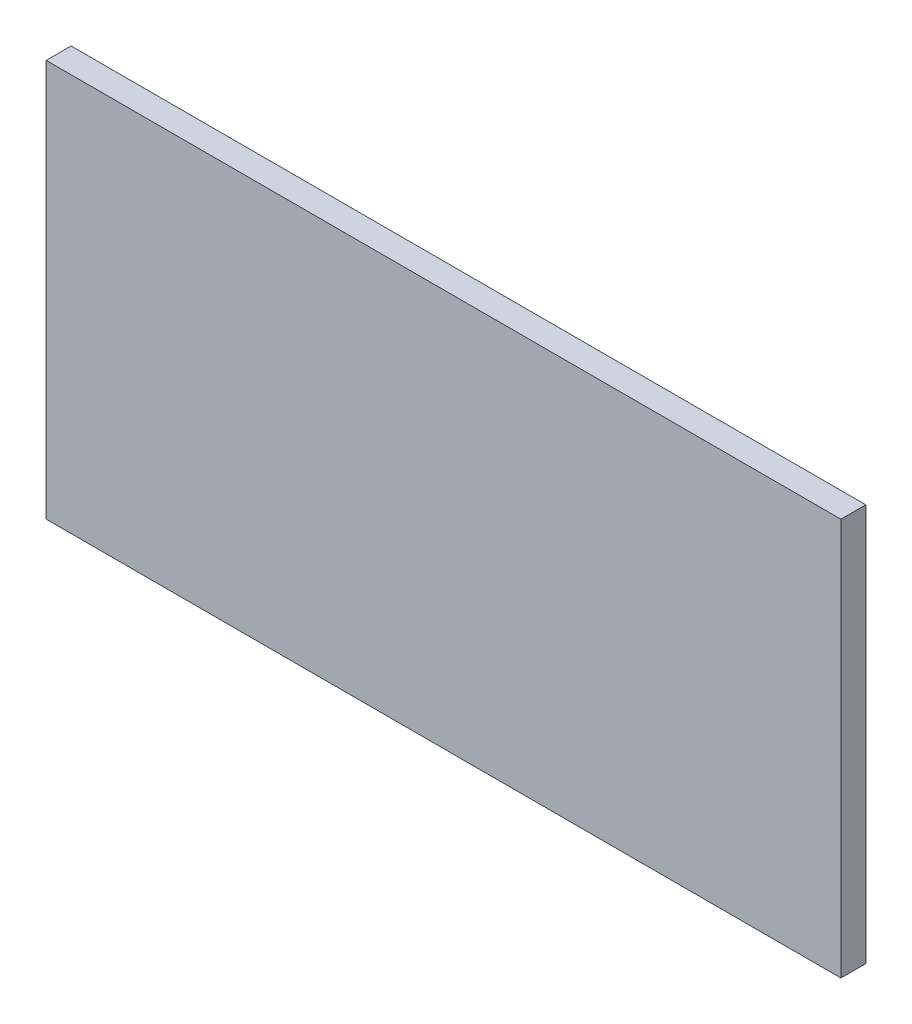
ISO-10303-21;
HEADER;
FILE_DESCRIPTION(('STEP AP214'),'2;1');
FILE_NAME('part.step','',(''),(''),'','','');
FILE_SCHEMA(('AUTOMOTIVE_DESIGN { 1 0 10303 214 1 1 1 1 }'));
ENDSEC;
DATA;
#1=APPLICATION_CONTEXT('core data for automotive mechanical design processes');
#2=APPLICATION_PROTOCOL_DEFINITION('international standard','automotive_design',2000,#1);
#3=PRODUCT_CONTEXT('',#1,'mechanical');
#4=PRODUCT('Part','Part','',(#3));
#5=PRODUCT_RELATED_PRODUCT_CATEGORY('part','',(#4));
#6=PRODUCT_DEFINITION_FORMATION('','',#4);
#7=PRODUCT_DEFINITION_CONTEXT('part definition',#1,'design');
#8=PRODUCT_DEFINITION('design','',#6,#7);
#9=PRODUCT_DEFINITION_SHAPE('','',#8);
#10=(LENGTH_UNIT() NAMED_UNIT(*) SI_UNIT(.MILLI.,.METRE.));
#11=(NAMED_UNIT(*) PLANE_ANGLE_UNIT() SI_UNIT($,.RADIAN.));
#12=(NAMED_UNIT(*) SI_UNIT($,.STERADIAN.) SOLID_ANGLE_UNIT());
#13=UNCERTAINTY_MEASURE_WITH_UNIT(LENGTH_MEASURE(1.E-05),#10,'distance_accuracy_value','');
#14=(GEOMETRIC_REPRESENTATION_CONTEXT(3) GLOBAL_UNCERTAINTY_ASSIGNED_CONTEXT((#13)) GLOBAL_UNIT_ASSIGNED_CONTEXT((#10,
#11,#12)) REPRESENTATION_CONTEXT('',''));
#15=CARTESIAN_POINT('',(0.,0.,0.));
#16=DIRECTION('',(0.,0.,1.));
#17=DIRECTION('',(1.,0.,0.));
#18=AXIS2_PLACEMENT_3D('',#15,#16,#17);
#19=CARTESIAN_POINT('',(190.5,-95.25,11.938));
#20=DIRECTION('',(-1.,0.,0.));
#21=DIRECTION('',(0.,0.,1.));
#22=AXIS2_PLACEMENT_3D('',#19,#20,#21);
#23=PLANE('',#22);
#24=DIRECTION('',(0.,1.,0.));
#25=VECTOR('',#24,1.);
#26=CARTESIAN_POINT('',(190.5,-95.25,0.));
#27=LINE('',#26,#25);
#28=CARTESIAN_POINT('',(190.5,-95.25,0.));
#29=VERTEX_POINT('',#28);
#30=CARTESIAN_POINT('',(190.5,95.25,0.));
#31=VERTEX_POINT('',#30);
#32=EDGE_CURVE('E98',#29,#31,#27,.T.);
#33=ORIENTED_EDGE('',*,*,#32,.T.);
#34=DIRECTION('',(0.,0.,-1.));
#35=VECTOR('',#34,1.);
#36=CARTESIAN_POINT('',(190.5,95.25,11.938));
#37=LINE('',#36,#35);
#38=CARTESIAN_POINT('',(190.5,95.25,11.938));
#39=VERTEX_POINT('',#38);
#40=EDGE_CURVE('E11',#39,#31,#37,.T.);
#41=ORIENTED_EDGE('',*,*,#40,.F.);
#42=DIRECTION('',(0.,1.,0.));
#43=VECTOR('',#42,1.);
#44=CARTESIAN_POINT('',(190.5,-95.25,11.938));
#45=LINE('',#44,#43);
#46=CARTESIAN_POINT('',(190.5,-95.25,11.938));
#47=VERTEX_POINT('',#46);
#48=EDGE_CURVE('E86',#47,#39,#45,.T.);
#49=ORIENTED_EDGE('',*,*,#48,.F.);
#50=DIRECTION('',(0.,0.,-1.));
#51=VECTOR('',#50,1.);
#52=CARTESIAN_POINT('',(190.5,-95.25,11.938));
#53=LINE('',#52,#51);
#54=EDGE_CURVE('E94',#47,#29,#53,.T.);
#55=ORIENTED_EDGE('',*,*,#54,.T.);
#56=EDGE_LOOP('',(#33,#41,#49,#55));
#57=FACE_BOUND('',#56,.T.);
#58=ADVANCED_FACE('F35',(#57),#23,.F.);
#59=CARTESIAN_POINT('',(-190.5,95.25,11.938));
#60=DIRECTION('',(0.,-1.,0.));
#61=DIRECTION('',(0.,0.,-1.));
#62=AXIS2_PLACEMENT_3D('',#59,#60,#61);
#63=PLANE('',#62);
#64=DIRECTION('',(-1.,0.,0.));
#65=VECTOR('',#64,1.);
#66=CARTESIAN_POINT('',(-190.5,95.25,0.));
#67=LINE('',#66,#65);
#68=CARTESIAN_POINT('',(-190.5,95.25,0.));
#69=VERTEX_POINT('',#68);
#70=EDGE_CURVE('E90',#31,#69,#67,.T.);
#71=ORIENTED_EDGE('',*,*,#70,.T.);
#72=DIRECTION('',(0.,0.,-1.));
#73=VECTOR('',#72,1.);
#74=CARTESIAN_POINT('',(-190.5,95.25,11.938));
#75=LINE('',#74,#73);
#76=CARTESIAN_POINT('',(-190.5,95.25,11.938));
#77=VERTEX_POINT('',#76);
#78=EDGE_CURVE('E43',#77,#69,#75,.T.);
#79=ORIENTED_EDGE('',*,*,#78,.F.);
#80=DIRECTION('',(-1.,0.,0.));
#81=VECTOR('',#80,1.);
#82=CARTESIAN_POINT('',(-190.5,95.25,11.938));
#83=LINE('',#82,#81);
#84=EDGE_CURVE('E81',#39,#77,#83,.T.);
#85=ORIENTED_EDGE('',*,*,#84,.F.);
#86=ORIENTED_EDGE('',*,*,#40,.T.);
#87=EDGE_LOOP('',(#71,#79,#85,#86));
#88=FACE_BOUND('',#87,.T.);
#89=ADVANCED_FACE('F89',(#88),#63,.F.);
#90=CARTESIAN_POINT('',(-190.5,-95.25,11.938));
#91=DIRECTION('',(1.,0.,0.));
#92=DIRECTION('',(0.,0.,-1.));
#93=AXIS2_PLACEMENT_3D('',#90,#91,#92);
#94=PLANE('',#93);
#95=DIRECTION('',(0.,-1.,0.));
#96=VECTOR('',#95,1.);
#97=CARTESIAN_POINT('',(-190.5,-95.25,0.));
#98=LINE('',#97,#96);
#99=CARTESIAN_POINT('',(-190.5,-95.25,0.));
#100=VERTEX_POINT('',#99);
#101=EDGE_CURVE('E68',#69,#100,#98,.T.);
#102=ORIENTED_EDGE('',*,*,#101,.T.);
#103=DIRECTION('',(0.,0.,-1.));
#104=VECTOR('',#103,1.);
#105=CARTESIAN_POINT('',(-190.5,-95.25,11.938));
#106=LINE('',#105,#104);
#107=CARTESIAN_POINT('',(-190.5,-95.25,11.938));
#108=VERTEX_POINT('',#107);
#109=EDGE_CURVE('E91',#108,#100,#106,.T.);
#110=ORIENTED_EDGE('',*,*,#109,.F.);
#111=DIRECTION('',(0.,-1.,0.));
#112=VECTOR('',#111,1.);
#113=CARTESIAN_POINT('',(-190.5,-95.25,11.938));
#114=LINE('',#113,#112);
#115=EDGE_CURVE('E84',#77,#108,#114,.T.);
#116=ORIENTED_EDGE('',*,*,#115,.F.);
#117=ORIENTED_EDGE('',*,*,#78,.T.);
#118=EDGE_LOOP('',(#102,#110,#116,#117));
#119=FACE_BOUND('',#118,.T.);
#120=ADVANCED_FACE('F92',(#119),#94,.F.);
#121=CARTESIAN_POINT('',(-190.5,-95.25,11.938));
#122=DIRECTION('',(0.,1.,0.));
#123=DIRECTION('',(0.,0.,1.));
#124=AXIS2_PLACEMENT_3D('',#121,#122,#123);
#125=PLANE('',#124);
#126=DIRECTION('',(1.,0.,0.));
#127=VECTOR('',#126,1.);
#128=CARTESIAN_POINT('',(-190.5,-95.25,0.));
#129=LINE('',#128,#127);
#130=EDGE_CURVE('E74',#100,#29,#129,.T.);
#131=ORIENTED_EDGE('',*,*,#130,.T.);
#132=ORIENTED_EDGE('',*,*,#54,.F.);
#133=DIRECTION('',(1.,0.,0.));
#134=VECTOR('',#133,1.);
#135=CARTESIAN_POINT('',(-190.5,-95.25,11.938));
#136=LINE('',#135,#134);
#137=EDGE_CURVE('E51',#108,#47,#136,.T.);
#138=ORIENTED_EDGE('',*,*,#137,.F.);
#139=ORIENTED_EDGE('',*,*,#109,.T.);
#140=EDGE_LOOP('',(#131,#132,#138,#139));
#141=FACE_BOUND('',#140,.T.);
#142=ADVANCED_FACE('F105',(#141),#125,.F.);
#143=CARTESIAN_POINT('',(0.,0.,11.938));
#144=DIRECTION('',(0.,0.,-1.));
#145=DIRECTION('',(-1.,0.,0.));
#146=AXIS2_PLACEMENT_3D('',#143,#144,#145);
#147=PLANE('',#146);
#148=ORIENTED_EDGE('',*,*,#48,.T.);
#149=ORIENTED_EDGE('',*,*,#84,.T.);
#150=ORIENTED_EDGE('',*,*,#115,.T.);
#151=ORIENTED_EDGE('',*,*,#137,.T.);
#152=EDGE_LOOP('',(#148,#149,#150,#151));
#153=FACE_BOUND('',#152,.T.);
#154=ADVANCED_FACE('F82',(#153),#147,.F.);
#155=CARTESIAN_POINT('',(0.,0.,0.));
#156=DIRECTION('',(0.,0.,-1.));
#157=DIRECTION('',(-1.,0.,0.));
#158=AXIS2_PLACEMENT_3D('',#155,#156,#157);
#159=PLANE('',#158);
#160=ORIENTED_EDGE('',*,*,#32,.F.);
#161=ORIENTED_EDGE('',*,*,#130,.F.);
#162=ORIENTED_EDGE('',*,*,#101,.F.);
#163=ORIENTED_EDGE('',*,*,#70,.F.);
#164=EDGE_LOOP('',(#160,#161,#162,#163));
#165=FACE_BOUND('',#164,.T.);
#166=ADVANCED_FACE('F108',(#165),#159,.T.);
#167=CLOSED_SHELL('',(#58,#89,#120,#142,#154,#166));
#168=MANIFOLD_SOLID_BREP('B2',#167);
#169=ADVANCED_BREP_SHAPE_REPRESENTATION('',(#18,#168),#14);
#170=SHAPE_DEFINITION_REPRESENTATION(#9,#169);
ENDSEC;
END-ISO-10303-21;
